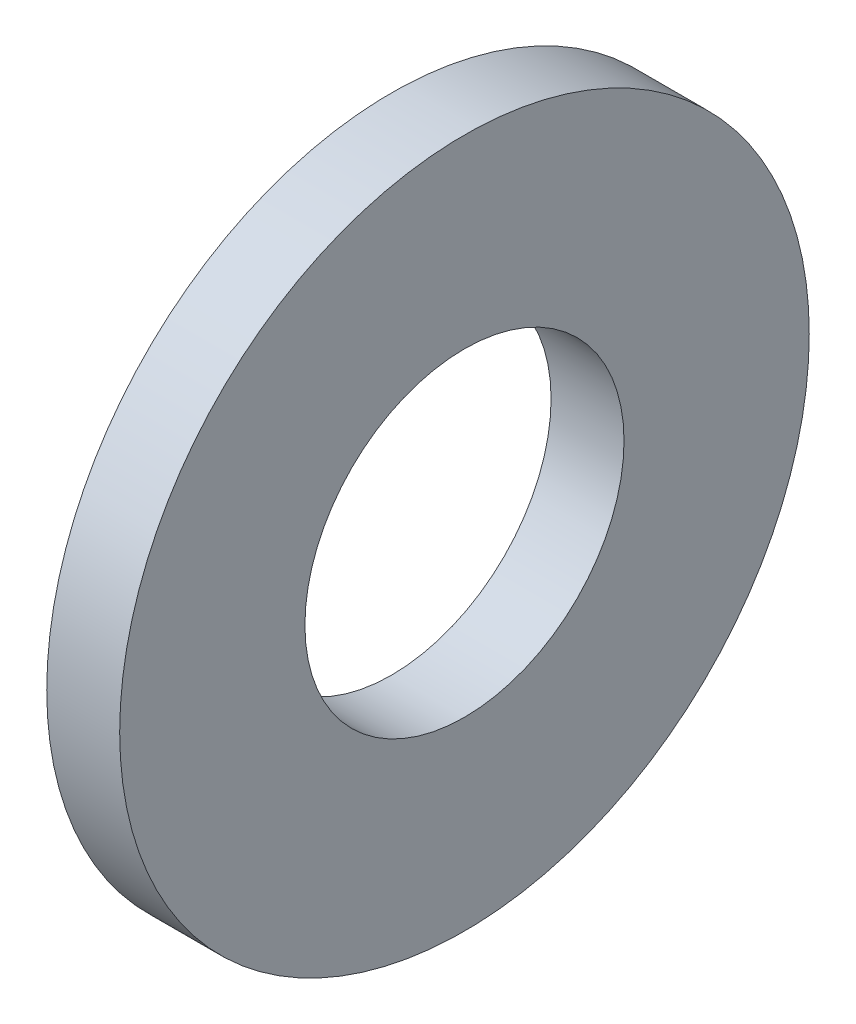
ISO-10303-21;
HEADER;
FILE_DESCRIPTION(('STEP AP214'),'2;1');
FILE_NAME('part.step','',(''),(''),'','','');
FILE_SCHEMA(('AUTOMOTIVE_DESIGN { 1 0 10303 214 1 1 1 1 }'));
ENDSEC;
DATA;
#1=APPLICATION_CONTEXT('core data for automotive mechanical design processes');
#2=APPLICATION_PROTOCOL_DEFINITION('international standard','automotive_design',2000,#1);
#3=PRODUCT_CONTEXT('',#1,'mechanical');
#4=PRODUCT('Part','Part','',(#3));
#5=PRODUCT_RELATED_PRODUCT_CATEGORY('part','',(#4));
#6=PRODUCT_DEFINITION_FORMATION('','',#4);
#7=PRODUCT_DEFINITION_CONTEXT('part definition',#1,'design');
#8=PRODUCT_DEFINITION('design','',#6,#7);
#9=PRODUCT_DEFINITION_SHAPE('','',#8);
#10=(LENGTH_UNIT() NAMED_UNIT(*) SI_UNIT(.MILLI.,.METRE.));
#11=(NAMED_UNIT(*) PLANE_ANGLE_UNIT() SI_UNIT($,.RADIAN.));
#12=(NAMED_UNIT(*) SI_UNIT($,.STERADIAN.) SOLID_ANGLE_UNIT());
#13=UNCERTAINTY_MEASURE_WITH_UNIT(LENGTH_MEASURE(1.E-05),#10,'distance_accuracy_value','');
#14=(GEOMETRIC_REPRESENTATION_CONTEXT(3) GLOBAL_UNCERTAINTY_ASSIGNED_CONTEXT((#13)) GLOBAL_UNIT_ASSIGNED_CONTEXT((#10,
#11,#12)) REPRESENTATION_CONTEXT('',''));
#15=CARTESIAN_POINT('',(0.,0.,0.));
#16=DIRECTION('',(0.,0.,1.));
#17=DIRECTION('',(1.,0.,0.));
#18=AXIS2_PLACEMENT_3D('',#15,#16,#17);
#19=CARTESIAN_POINT('',(1.37499999999997,0.,0.));
#20=DIRECTION('',(1.,0.,0.));
#21=DIRECTION('',(0.,0.,-1.));
#22=AXIS2_PLACEMENT_3D('',#19,#20,#21);
#23=PLANE('',#22);
#24=CARTESIAN_POINT('',(1.37499999999997,0.,0.));
#25=DIRECTION('',(1.,0.,0.));
#26=DIRECTION('',(0.,0.,-1.));
#27=AXIS2_PLACEMENT_3D('',#24,#25,#26);
#28=CIRCLE('',#27,13.);
#29=CARTESIAN_POINT('',(1.37499999999997,0.,-13.));
#30=VERTEX_POINT('',#29);
#31=EDGE_CURVE('E10',#30,#30,#28,.T.);
#32=ORIENTED_EDGE('',*,*,#31,.T.);
#33=EDGE_LOOP('',(#32));
#34=FACE_BOUND('',#33,.T.);
#35=CARTESIAN_POINT('',(1.37499999999997,0.,0.));
#36=DIRECTION('',(1.,0.,0.));
#37=DIRECTION('',(0.,0.,-1.));
#38=AXIS2_PLACEMENT_3D('',#35,#36,#37);
#39=CIRCLE('',#38,6.016);
#40=CARTESIAN_POINT('',(1.37499999999997,0.,-6.016));
#41=VERTEX_POINT('',#40);
#42=EDGE_CURVE('E42',#41,#41,#39,.T.);
#43=ORIENTED_EDGE('',*,*,#42,.F.);
#44=EDGE_LOOP('',(#43));
#45=FACE_BOUND('',#44,.T.);
#46=ADVANCED_FACE('F35',(#34,#45),#23,.T.);
#47=CARTESIAN_POINT('',(1.37499999999997,0.,0.));
#48=DIRECTION('',(-1.,0.,0.));
#49=DIRECTION('',(0.,0.,1.));
#50=AXIS2_PLACEMENT_3D('',#47,#48,#49);
#51=CYLINDRICAL_SURFACE('',#50,13.);
#52=ORIENTED_EDGE('',*,*,#31,.F.);
#53=EDGE_LOOP('',(#52));
#54=FACE_BOUND('',#53,.T.);
#55=CARTESIAN_POINT('',(-1.37500000000003,0.,0.));
#56=DIRECTION('',(1.,0.,0.));
#57=DIRECTION('',(0.,0.,-1.));
#58=AXIS2_PLACEMENT_3D('',#55,#56,#57);
#59=CIRCLE('',#58,13.);
#60=CARTESIAN_POINT('',(-1.37500000000003,0.,-13.));
#61=VERTEX_POINT('',#60);
#62=EDGE_CURVE('E46',#61,#61,#59,.T.);
#63=ORIENTED_EDGE('',*,*,#62,.T.);
#64=EDGE_LOOP('',(#63));
#65=FACE_BOUND('',#64,.T.);
#66=ADVANCED_FACE('F37',(#54,#65),#51,.T.);
#67=CARTESIAN_POINT('',(1.37499999999997,0.,0.));
#68=DIRECTION('',(-1.,0.,0.));
#69=DIRECTION('',(0.,0.,1.));
#70=AXIS2_PLACEMENT_3D('',#67,#68,#69);
#71=CYLINDRICAL_SURFACE('',#70,6.016);
#72=ORIENTED_EDGE('',*,*,#42,.T.);
#73=EDGE_LOOP('',(#72));
#74=FACE_BOUND('',#73,.T.);
#75=CARTESIAN_POINT('',(-1.37500000000003,0.,0.));
#76=DIRECTION('',(1.,0.,0.));
#77=DIRECTION('',(0.,0.,-1.));
#78=AXIS2_PLACEMENT_3D('',#75,#76,#77);
#79=CIRCLE('',#78,6.016);
#80=CARTESIAN_POINT('',(-1.37500000000003,0.,-6.016));
#81=VERTEX_POINT('',#80);
#82=EDGE_CURVE('E50',#81,#81,#79,.T.);
#83=ORIENTED_EDGE('',*,*,#82,.F.);
#84=EDGE_LOOP('',(#83));
#85=FACE_BOUND('',#84,.T.);
#86=ADVANCED_FACE('F59',(#74,#85),#71,.F.);
#87=CARTESIAN_POINT('',(-1.37500000000003,0.,0.));
#88=DIRECTION('',(1.,0.,0.));
#89=DIRECTION('',(0.,0.,-1.));
#90=AXIS2_PLACEMENT_3D('',#87,#88,#89);
#91=PLANE('',#90);
#92=ORIENTED_EDGE('',*,*,#82,.T.);
#93=EDGE_LOOP('',(#92));
#94=FACE_BOUND('',#93,.T.);
#95=ORIENTED_EDGE('',*,*,#62,.F.);
#96=EDGE_LOOP('',(#95));
#97=FACE_BOUND('',#96,.T.);
#98=ADVANCED_FACE('F56',(#94,#97),#91,.F.);
#99=CLOSED_SHELL('',(#46,#66,#86,#98));
#100=MANIFOLD_SOLID_BREP('B2',#99);
#101=ADVANCED_BREP_SHAPE_REPRESENTATION('',(#18,#100),#14);
#102=SHAPE_DEFINITION_REPRESENTATION(#9,#101);
ENDSEC;
END-ISO-10303-21;
